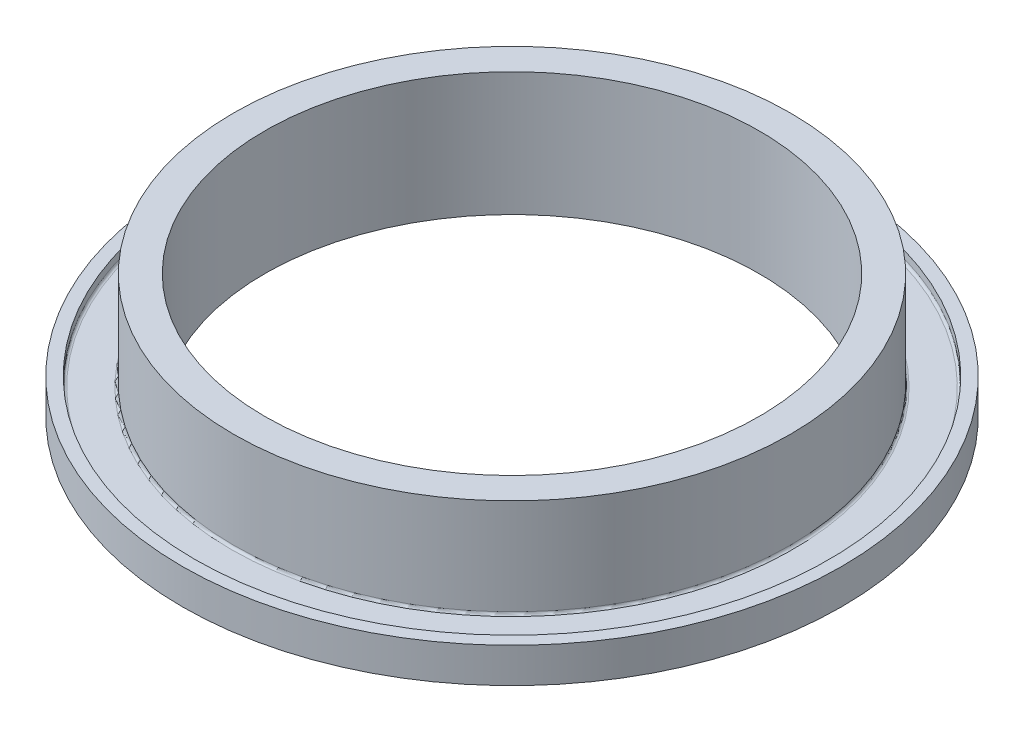
ISO-10303-21;
HEADER;
FILE_DESCRIPTION(('STEP AP214'),'2;1');
FILE_NAME('part.step','',(''),(''),'','','');
FILE_SCHEMA(('AUTOMOTIVE_DESIGN { 1 0 10303 214 1 1 1 1 }'));
ENDSEC;
DATA;
#1=APPLICATION_CONTEXT('core data for automotive mechanical design processes');
#2=APPLICATION_PROTOCOL_DEFINITION('international standard','automotive_design',2000,#1);
#3=PRODUCT_CONTEXT('',#1,'mechanical');
#4=PRODUCT('Part','Part','',(#3));
#5=PRODUCT_RELATED_PRODUCT_CATEGORY('part','',(#4));
#6=PRODUCT_DEFINITION_FORMATION('','',#4);
#7=PRODUCT_DEFINITION_CONTEXT('part definition',#1,'design');
#8=PRODUCT_DEFINITION('design','',#6,#7);
#9=PRODUCT_DEFINITION_SHAPE('','',#8);
#10=(LENGTH_UNIT() NAMED_UNIT(*) SI_UNIT(.MILLI.,.METRE.));
#11=(NAMED_UNIT(*) PLANE_ANGLE_UNIT() SI_UNIT($,.RADIAN.));
#12=(NAMED_UNIT(*) SI_UNIT($,.STERADIAN.) SOLID_ANGLE_UNIT());
#13=UNCERTAINTY_MEASURE_WITH_UNIT(LENGTH_MEASURE(1.E-05),#10,'distance_accuracy_value','');
#14=(GEOMETRIC_REPRESENTATION_CONTEXT(3) GLOBAL_UNCERTAINTY_ASSIGNED_CONTEXT((#13)) GLOBAL_UNIT_ASSIGNED_CONTEXT((#10,
#11,#12)) REPRESENTATION_CONTEXT('',''));
#15=CARTESIAN_POINT('',(0.,0.,0.));
#16=DIRECTION('',(0.,0.,1.));
#17=DIRECTION('',(1.,0.,0.));
#18=AXIS2_PLACEMENT_3D('',#15,#16,#17);
#19=CARTESIAN_POINT('',(0.,25.4,0.));
#20=DIRECTION('',(0.,-1.,0.));
#21=DIRECTION('',(0.,0.,-1.));
#22=AXIS2_PLACEMENT_3D('',#19,#20,#21);
#23=CYLINDRICAL_SURFACE('',#22,57.15);
#24=CARTESIAN_POINT('',(0.,1.5,0.));
#25=DIRECTION('',(0.,-1.,0.));
#26=DIRECTION('',(0.,0.,-1.));
#27=AXIS2_PLACEMENT_3D('',#24,#25,#26);
#28=CIRCLE('',#27,57.15);
#29=CARTESIAN_POINT('',(0.,1.5,-57.15));
#30=VERTEX_POINT('',#29);
#31=EDGE_CURVE('E38',#30,#30,#28,.T.);
#32=ORIENTED_EDGE('',*,*,#31,.T.);
#33=EDGE_LOOP('',(#32));
#34=FACE_BOUND('',#33,.T.);
#35=CARTESIAN_POINT('',(0.,0.,0.));
#36=DIRECTION('',(0.,1.,0.));
#37=DIRECTION('',(0.,0.,1.));
#38=AXIS2_PLACEMENT_3D('',#35,#36,#37);
#39=CIRCLE('',#38,57.15);
#40=CARTESIAN_POINT('',(0.,0.,57.15));
#41=VERTEX_POINT('',#40);
#42=EDGE_CURVE('E64',#41,#41,#39,.T.);
#43=ORIENTED_EDGE('',*,*,#42,.T.);
#44=EDGE_LOOP('',(#43));
#45=FACE_BOUND('',#44,.T.);
#46=ADVANCED_FACE('F31',(#34,#45),#23,.T.);
#47=CARTESIAN_POINT('',(0.,25.4,0.));
#48=DIRECTION('',(0.,1.,0.));
#49=DIRECTION('',(0.,0.,1.));
#50=AXIS2_PLACEMENT_3D('',#47,#48,#49);
#51=PLANE('',#50);
#52=CARTESIAN_POINT('',(0.,25.4,0.));
#53=DIRECTION('',(0.,1.,0.));
#54=DIRECTION('',(0.,0.,1.));
#55=AXIS2_PLACEMENT_3D('',#52,#53,#54);
#56=CIRCLE('',#55,57.15);
#57=CARTESIAN_POINT('',(0.,25.4,57.15));
#58=VERTEX_POINT('',#57);
#59=EDGE_CURVE('E63',#58,#58,#56,.T.);
#60=ORIENTED_EDGE('',*,*,#59,.T.);
#61=EDGE_LOOP('',(#60));
#62=FACE_BOUND('',#61,.T.);
#63=CARTESIAN_POINT('',(0.,25.4,0.));
#64=DIRECTION('',(0.,1.,0.));
#65=DIRECTION('',(0.,0.,1.));
#66=AXIS2_PLACEMENT_3D('',#63,#64,#65);
#67=CIRCLE('',#66,50.7746);
#68=CARTESIAN_POINT('',(0.,25.4,50.7746));
#69=VERTEX_POINT('',#68);
#70=EDGE_CURVE('E67',#69,#69,#67,.T.);
#71=ORIENTED_EDGE('',*,*,#70,.F.);
#72=EDGE_LOOP('',(#71));
#73=FACE_BOUND('',#72,.T.);
#74=ADVANCED_FACE('F106',(#62,#73),#51,.T.);
#75=CARTESIAN_POINT('',(0.,0.,0.));
#76=DIRECTION('',(0.,1.,0.));
#77=DIRECTION('',(0.,0.,1.));
#78=AXIS2_PLACEMENT_3D('',#75,#76,#77);
#79=PLANE('',#78);
#80=ORIENTED_EDGE('',*,*,#42,.F.);
#81=EDGE_LOOP('',(#80));
#82=FACE_BOUND('',#81,.T.);
#83=CARTESIAN_POINT('',(0.,0.,0.));
#84=DIRECTION('',(0.,1.,0.));
#85=DIRECTION('',(0.,0.,1.));
#86=AXIS2_PLACEMENT_3D('',#83,#84,#85);
#87=CIRCLE('',#86,50.7746);
#88=CARTESIAN_POINT('',(0.,0.,50.7746));
#89=VERTEX_POINT('',#88);
#90=EDGE_CURVE('E70',#89,#89,#87,.T.);
#91=ORIENTED_EDGE('',*,*,#90,.T.);
#92=EDGE_LOOP('',(#91));
#93=FACE_BOUND('',#92,.T.);
#94=ADVANCED_FACE('F113',(#82,#93),#79,.F.);
#95=CARTESIAN_POINT('',(0.,5.675,0.));
#96=DIRECTION('',(0.,1.,0.));
#97=DIRECTION('',(0.,0.,1.));
#98=AXIS2_PLACEMENT_3D('',#95,#96,#97);
#99=CIRCLE('',#98,57.15);
#100=CARTESIAN_POINT('',(0.,5.675,57.15));
#101=VERTEX_POINT('',#100);
#102=EDGE_CURVE('E51',#101,#101,#99,.T.);
#103=ORIENTED_EDGE('',*,*,#102,.T.);
#104=EDGE_LOOP('',(#103));
#105=FACE_BOUND('',#104,.T.);
#106=ORIENTED_EDGE('',*,*,#59,.F.);
#107=EDGE_LOOP('',(#106));
#108=FACE_BOUND('',#107,.T.);
#109=ADVANCED_FACE('F108',(#105,#108),#23,.T.);
#110=CARTESIAN_POINT('',(0.,25.4,0.));
#111=DIRECTION('',(0.,-1.,0.));
#112=DIRECTION('',(0.,0.,-1.));
#113=AXIS2_PLACEMENT_3D('',#110,#111,#112);
#114=CYLINDRICAL_SURFACE('',#113,50.7746);
#115=ORIENTED_EDGE('',*,*,#70,.T.);
#116=EDGE_LOOP('',(#115));
#117=FACE_BOUND('',#116,.T.);
#118=ORIENTED_EDGE('',*,*,#90,.F.);
#119=EDGE_LOOP('',(#118));
#120=FACE_BOUND('',#119,.T.);
#121=ADVANCED_FACE('F119',(#117,#120),#114,.F.);
#122=CARTESIAN_POINT('',(-57.15,2.,0.));
#123=DIRECTION('',(0.,-1.,0.));
#124=DIRECTION('',(0.,0.,-1.));
#125=AXIS2_PLACEMENT_3D('',#122,#123,#124);
#126=PLANE('',#125);
#127=CARTESIAN_POINT('',(0.,2.,0.));
#128=DIRECTION('',(0.,-1.,0.));
#129=DIRECTION('',(0.,0.,-1.));
#130=AXIS2_PLACEMENT_3D('',#127,#128,#129);
#131=CIRCLE('',#130,57.65);
#132=CARTESIAN_POINT('',(0.,2.,-57.65));
#133=VERTEX_POINT('',#132);
#134=EDGE_CURVE('E42',#133,#133,#131,.F.);
#135=ORIENTED_EDGE('',*,*,#134,.T.);
#136=EDGE_LOOP('',(#135));
#137=FACE_BOUND('',#136,.T.);
#138=CARTESIAN_POINT('',(0.,2.,0.));
#139=DIRECTION('',(0.,-1.,0.));
#140=DIRECTION('',(0.,0.,-1.));
#141=AXIS2_PLACEMENT_3D('',#138,#139,#140);
#142=CIRCLE('',#141,64.65);
#143=CARTESIAN_POINT('',(0.,2.,-64.65));
#144=VERTEX_POINT('',#143);
#145=EDGE_CURVE('E46',#144,#144,#142,.T.);
#146=ORIENTED_EDGE('',*,*,#145,.T.);
#147=EDGE_LOOP('',(#146));
#148=FACE_BOUND('',#147,.T.);
#149=ADVANCED_FACE('F125',(#137,#148),#126,.T.);
#150=CARTESIAN_POINT('',(0.,25.4,0.));
#151=DIRECTION('',(0.,1.,0.));
#152=DIRECTION('',(0.,0.,1.));
#153=AXIS2_PLACEMENT_3D('',#150,#151,#152);
#154=CYLINDRICAL_SURFACE('',#153,65.15);
#155=CARTESIAN_POINT('',(0.,1.5,0.));
#156=DIRECTION('',(0.,-1.,0.));
#157=DIRECTION('',(0.,0.,-1.));
#158=AXIS2_PLACEMENT_3D('',#155,#156,#157);
#159=CIRCLE('',#158,65.15);
#160=CARTESIAN_POINT('',(0.,1.5,-65.15));
#161=VERTEX_POINT('',#160);
#162=EDGE_CURVE('E10',#161,#161,#159,.F.);
#163=ORIENTED_EDGE('',*,*,#162,.T.);
#164=EDGE_LOOP('',(#163));
#165=FACE_BOUND('',#164,.T.);
#166=CARTESIAN_POINT('',(0.,0.,0.));
#167=DIRECTION('',(0.,1.,0.));
#168=DIRECTION('',(0.,0.,1.));
#169=AXIS2_PLACEMENT_3D('',#166,#167,#168);
#170=CIRCLE('',#169,65.15);
#171=CARTESIAN_POINT('',(0.,0.,65.15));
#172=VERTEX_POINT('',#171);
#173=EDGE_CURVE('E73',#172,#172,#170,.T.);
#174=ORIENTED_EDGE('',*,*,#173,.F.);
#175=EDGE_LOOP('',(#174));
#176=FACE_BOUND('',#175,.T.);
#177=ADVANCED_FACE('F192',(#165,#176),#154,.F.);
#178=CARTESIAN_POINT('',(-65.15,0.,0.));
#179=DIRECTION('',(0.,-1.,0.));
#180=DIRECTION('',(0.,0.,-1.));
#181=AXIS2_PLACEMENT_3D('',#178,#179,#180);
#182=PLANE('',#181);
#183=ORIENTED_EDGE('',*,*,#173,.T.);
#184=EDGE_LOOP('',(#183));
#185=FACE_BOUND('',#184,.T.);
#186=CARTESIAN_POINT('',(0.,0.,0.));
#187=DIRECTION('',(0.,1.,0.));
#188=DIRECTION('',(0.,0.,1.));
#189=AXIS2_PLACEMENT_3D('',#186,#187,#188);
#190=CIRCLE('',#189,67.69);
#191=CARTESIAN_POINT('',(0.,0.,67.69));
#192=VERTEX_POINT('',#191);
#193=EDGE_CURVE('E78',#192,#192,#190,.T.);
#194=ORIENTED_EDGE('',*,*,#193,.F.);
#195=EDGE_LOOP('',(#194));
#196=FACE_BOUND('',#195,.T.);
#197=ADVANCED_FACE('F102',(#185,#196),#182,.T.);
#198=CARTESIAN_POINT('',(0.,25.4,0.));
#199=DIRECTION('',(0.,1.,0.));
#200=DIRECTION('',(0.,0.,1.));
#201=AXIS2_PLACEMENT_3D('',#198,#199,#200);
#202=CYLINDRICAL_SURFACE('',#201,67.69);
#203=ORIENTED_EDGE('',*,*,#193,.T.);
#204=EDGE_LOOP('',(#203));
#205=FACE_BOUND('',#204,.T.);
#206=CARTESIAN_POINT('',(0.,7.17499999999999,0.));
#207=DIRECTION('',(0.,1.,0.));
#208=DIRECTION('',(0.,0.,1.));
#209=AXIS2_PLACEMENT_3D('',#206,#207,#208);
#210=CIRCLE('',#209,67.69);
#211=CARTESIAN_POINT('',(0.,7.17499999999999,67.69));
#212=VERTEX_POINT('',#211);
#213=EDGE_CURVE('E81',#212,#212,#210,.T.);
#214=ORIENTED_EDGE('',*,*,#213,.F.);
#215=EDGE_LOOP('',(#214));
#216=FACE_BOUND('',#215,.T.);
#217=ADVANCED_FACE('F92',(#205,#216),#202,.T.);
#218=CARTESIAN_POINT('',(-65.15,7.17499999999999,0.));
#219=DIRECTION('',(0.,1.,0.));
#220=DIRECTION('',(0.,0.,1.));
#221=AXIS2_PLACEMENT_3D('',#218,#219,#220);
#222=PLANE('',#221);
#223=ORIENTED_EDGE('',*,*,#213,.T.);
#224=EDGE_LOOP('',(#223));
#225=FACE_BOUND('',#224,.T.);
#226=CARTESIAN_POINT('',(0.,7.17499999999999,0.));
#227=DIRECTION('',(0.,1.,0.));
#228=DIRECTION('',(0.,0.,1.));
#229=AXIS2_PLACEMENT_3D('',#226,#227,#228);
#230=CIRCLE('',#229,65.15);
#231=CARTESIAN_POINT('',(0.,7.17499999999999,65.15));
#232=VERTEX_POINT('',#231);
#233=EDGE_CURVE('E84',#232,#232,#230,.T.);
#234=ORIENTED_EDGE('',*,*,#233,.F.);
#235=EDGE_LOOP('',(#234));
#236=FACE_BOUND('',#235,.T.);
#237=ADVANCED_FACE('F90',(#225,#236),#222,.T.);
#238=CARTESIAN_POINT('',(0.,25.4,0.));
#239=DIRECTION('',(0.,1.,0.));
#240=DIRECTION('',(0.,0.,1.));
#241=AXIS2_PLACEMENT_3D('',#238,#239,#240);
#242=CYLINDRICAL_SURFACE('',#241,65.15);
#243=CARTESIAN_POINT('',(0.,5.675,0.));
#244=DIRECTION('',(0.,1.,0.));
#245=DIRECTION('',(0.,0.,1.));
#246=AXIS2_PLACEMENT_3D('',#243,#244,#245);
#247=CIRCLE('',#246,65.15);
#248=CARTESIAN_POINT('',(0.,5.675,65.15));
#249=VERTEX_POINT('',#248);
#250=EDGE_CURVE('E54',#249,#249,#247,.F.);
#251=ORIENTED_EDGE('',*,*,#250,.T.);
#252=EDGE_LOOP('',(#251));
#253=FACE_BOUND('',#252,.T.);
#254=ORIENTED_EDGE('',*,*,#233,.T.);
#255=EDGE_LOOP('',(#254));
#256=FACE_BOUND('',#255,.T.);
#257=ADVANCED_FACE('F88',(#253,#256),#242,.F.);
#258=CARTESIAN_POINT('',(-57.15,5.175,0.));
#259=DIRECTION('',(0.,1.,0.));
#260=DIRECTION('',(0.,0.,1.));
#261=AXIS2_PLACEMENT_3D('',#258,#259,#260);
#262=PLANE('',#261);
#263=CARTESIAN_POINT('',(0.,5.175,0.));
#264=DIRECTION('',(0.,1.,0.));
#265=DIRECTION('',(0.,0.,1.));
#266=AXIS2_PLACEMENT_3D('',#263,#264,#265);
#267=CIRCLE('',#266,64.65);
#268=CARTESIAN_POINT('',(0.,5.175,64.65));
#269=VERTEX_POINT('',#268);
#270=EDGE_CURVE('E57',#269,#269,#267,.T.);
#271=ORIENTED_EDGE('',*,*,#270,.T.);
#272=EDGE_LOOP('',(#271));
#273=FACE_BOUND('',#272,.T.);
#274=CARTESIAN_POINT('',(0.,5.175,0.));
#275=DIRECTION('',(0.,1.,0.));
#276=DIRECTION('',(0.,0.,1.));
#277=AXIS2_PLACEMENT_3D('',#274,#275,#276);
#278=CIRCLE('',#277,57.65);
#279=CARTESIAN_POINT('',(0.,5.175,57.65));
#280=VERTEX_POINT('',#279);
#281=EDGE_CURVE('E60',#280,#280,#278,.F.);
#282=ORIENTED_EDGE('',*,*,#281,.T.);
#283=EDGE_LOOP('',(#282));
#284=FACE_BOUND('',#283,.T.);
#285=ADVANCED_FACE('F99',(#273,#284),#262,.T.);
#286=CARTESIAN_POINT('',(0.,5.675,0.));
#287=DIRECTION('',(0.,1.,0.));
#288=DIRECTION('',(0.,0.,1.));
#289=AXIS2_PLACEMENT_3D('',#286,#287,#288);
#290=TOROIDAL_SURFACE('',#289,64.65,0.5);
#291=ORIENTED_EDGE('',*,*,#250,.F.);
#292=EDGE_LOOP('',(#291));
#293=FACE_BOUND('',#292,.T.);
#294=ORIENTED_EDGE('',*,*,#270,.F.);
#295=EDGE_LOOP('',(#294));
#296=FACE_BOUND('',#295,.T.);
#297=ADVANCED_FACE('F142',(#293,#296),#290,.F.);
#298=CARTESIAN_POINT('',(0.,5.675,0.));
#299=DIRECTION('',(0.,1.,0.));
#300=DIRECTION('',(0.,0.,1.));
#301=AXIS2_PLACEMENT_3D('',#298,#299,#300);
#302=TOROIDAL_SURFACE('',#301,57.65,0.5);
#303=ORIENTED_EDGE('',*,*,#281,.F.);
#304=EDGE_LOOP('',(#303));
#305=FACE_BOUND('',#304,.T.);
#306=ORIENTED_EDGE('',*,*,#102,.F.);
#307=EDGE_LOOP('',(#306));
#308=FACE_BOUND('',#307,.T.);
#309=ADVANCED_FACE('F139',(#305,#308),#302,.F.);
#310=CARTESIAN_POINT('',(0.,1.5,0.));
#311=DIRECTION('',(0.,-1.,0.));
#312=DIRECTION('',(0.,0.,-1.));
#313=AXIS2_PLACEMENT_3D('',#310,#311,#312);
#314=TOROIDAL_SURFACE('',#313,57.65,0.5);
#315=ORIENTED_EDGE('',*,*,#31,.F.);
#316=EDGE_LOOP('',(#315));
#317=FACE_BOUND('',#316,.T.);
#318=ORIENTED_EDGE('',*,*,#134,.F.);
#319=EDGE_LOOP('',(#318));
#320=FACE_BOUND('',#319,.T.);
#321=ADVANCED_FACE('F141',(#317,#320),#314,.F.);
#322=CARTESIAN_POINT('',(0.,1.5,0.));
#323=DIRECTION('',(0.,-1.,0.));
#324=DIRECTION('',(0.,0.,-1.));
#325=AXIS2_PLACEMENT_3D('',#322,#323,#324);
#326=TOROIDAL_SURFACE('',#325,64.65,0.5);
#327=ORIENTED_EDGE('',*,*,#145,.F.);
#328=EDGE_LOOP('',(#327));
#329=FACE_BOUND('',#328,.T.);
#330=ORIENTED_EDGE('',*,*,#162,.F.);
#331=EDGE_LOOP('',(#330));
#332=FACE_BOUND('',#331,.T.);
#333=ADVANCED_FACE('F33',(#329,#332),#326,.F.);
#334=CLOSED_SHELL('',(#46,#74,#94,#109,#121,#149,#177,#197,#217,#237,#257,#285,#297,#309,#321,#333));
#335=MANIFOLD_SOLID_BREP('B2',#334);
#336=ADVANCED_BREP_SHAPE_REPRESENTATION('',(#18,#335),#14);
#337=SHAPE_DEFINITION_REPRESENTATION(#9,#336);
ENDSEC;
END-ISO-10303-21;
